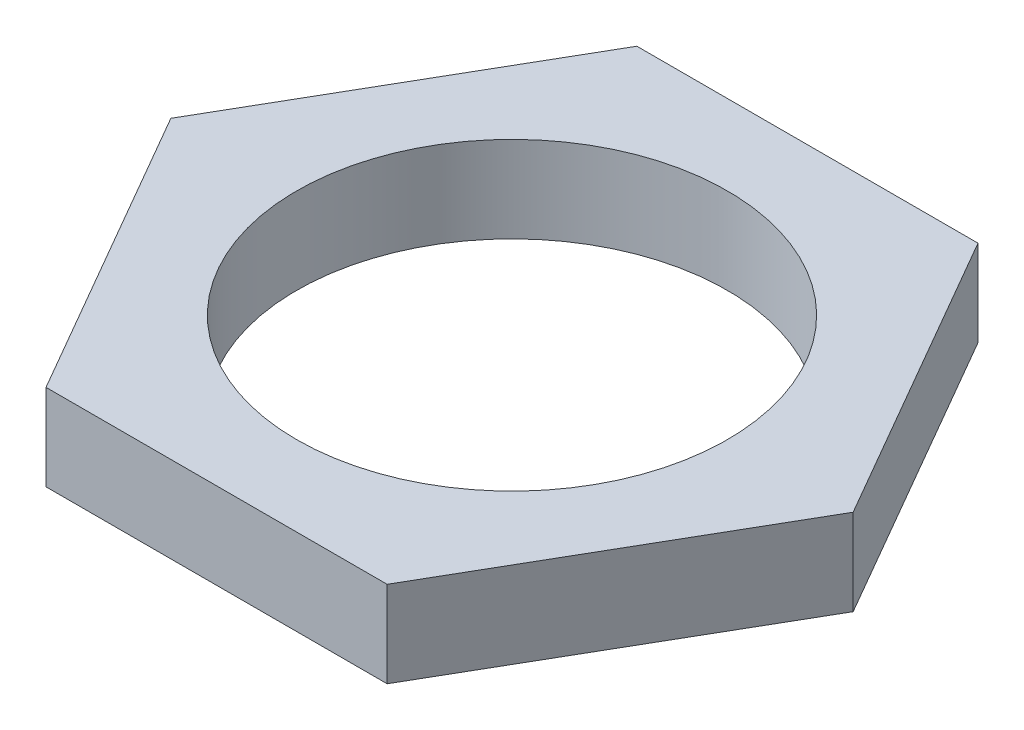
ISO-10303-21;
HEADER;
FILE_DESCRIPTION(('STEP AP214'),'2;1');
FILE_NAME('part.step','',(''),(''),'','','');
FILE_SCHEMA(('AUTOMOTIVE_DESIGN { 1 0 10303 214 1 1 1 1 }'));
ENDSEC;
DATA;
#1=APPLICATION_CONTEXT('core data for automotive mechanical design processes');
#2=APPLICATION_PROTOCOL_DEFINITION('international standard','automotive_design',2000,#1);
#3=PRODUCT_CONTEXT('',#1,'mechanical');
#4=PRODUCT('Part','Part','',(#3));
#5=PRODUCT_RELATED_PRODUCT_CATEGORY('part','',(#4));
#6=PRODUCT_DEFINITION_FORMATION('','',#4);
#7=PRODUCT_DEFINITION_CONTEXT('part definition',#1,'design');
#8=PRODUCT_DEFINITION('design','',#6,#7);
#9=PRODUCT_DEFINITION_SHAPE('','',#8);
#10=(LENGTH_UNIT() NAMED_UNIT(*) SI_UNIT(.MILLI.,.METRE.));
#11=(NAMED_UNIT(*) PLANE_ANGLE_UNIT() SI_UNIT($,.RADIAN.));
#12=(NAMED_UNIT(*) SI_UNIT($,.STERADIAN.) SOLID_ANGLE_UNIT());
#13=UNCERTAINTY_MEASURE_WITH_UNIT(LENGTH_MEASURE(1.E-05),#10,'distance_accuracy_value','');
#14=(GEOMETRIC_REPRESENTATION_CONTEXT(3) GLOBAL_UNCERTAINTY_ASSIGNED_CONTEXT((#13)) GLOBAL_UNIT_ASSIGNED_CONTEXT((#10,
#11,#12)) REPRESENTATION_CONTEXT('',''));
#15=CARTESIAN_POINT('',(0.,0.,0.));
#16=DIRECTION('',(0.,0.,1.));
#17=DIRECTION('',(1.,0.,0.));
#18=AXIS2_PLACEMENT_3D('',#15,#16,#17);
#19=CARTESIAN_POINT('',(0.,3.5,0.));
#20=DIRECTION('',(0.,1.,0.));
#21=DIRECTION('',(0.,0.,1.));
#22=AXIS2_PLACEMENT_3D('',#19,#20,#21);
#23=PLANE('',#22);
#24=DIRECTION('',(0.5,0.,0.866025403784438));
#25=VECTOR('',#24,1.);
#26=CARTESIAN_POINT('',(-13.856406460551,3.5,0.));
#27=LINE('',#26,#25);
#28=CARTESIAN_POINT('',(-13.856406460551,3.5,0.));
#29=VERTEX_POINT('',#28);
#30=CARTESIAN_POINT('',(-6.92820323027551,3.5,12.));
#31=VERTEX_POINT('',#30);
#32=EDGE_CURVE('E138',#29,#31,#27,.T.);
#33=ORIENTED_EDGE('',*,*,#32,.T.);
#34=DIRECTION('',(1.,0.,0.));
#35=VECTOR('',#34,1.);
#36=CARTESIAN_POINT('',(-6.92820323027551,3.5,12.));
#37=LINE('',#36,#35);
#38=CARTESIAN_POINT('',(6.92820323027551,3.5,12.));
#39=VERTEX_POINT('',#38);
#40=EDGE_CURVE('E96',#31,#39,#37,.T.);
#41=ORIENTED_EDGE('',*,*,#40,.T.);
#42=DIRECTION('',(0.5,0.,-0.866025403784439));
#43=VECTOR('',#42,1.);
#44=CARTESIAN_POINT('',(6.92820323027551,3.5,12.));
#45=LINE('',#44,#43);
#46=CARTESIAN_POINT('',(13.856406460551,3.5,0.));
#47=VERTEX_POINT('',#46);
#48=EDGE_CURVE('E109',#39,#47,#45,.T.);
#49=ORIENTED_EDGE('',*,*,#48,.T.);
#50=DIRECTION('',(-0.5,0.,-0.866025403784439));
#51=VECTOR('',#50,1.);
#52=CARTESIAN_POINT('',(13.856406460551,3.5,0.));
#53=LINE('',#52,#51);
#54=CARTESIAN_POINT('',(6.92820323027551,3.5,-12.));
#55=VERTEX_POINT('',#54);
#56=EDGE_CURVE('E103',#47,#55,#53,.T.);
#57=ORIENTED_EDGE('',*,*,#56,.T.);
#58=DIRECTION('',(-1.,0.,0.));
#59=VECTOR('',#58,1.);
#60=CARTESIAN_POINT('',(6.92820323027551,3.5,-12.));
#61=LINE('',#60,#59);
#62=CARTESIAN_POINT('',(-6.92820323027551,3.5,-12.));
#63=VERTEX_POINT('',#62);
#64=EDGE_CURVE('E107',#55,#63,#61,.T.);
#65=ORIENTED_EDGE('',*,*,#64,.T.);
#66=DIRECTION('',(-0.5,0.,0.866025403784439));
#67=VECTOR('',#66,1.);
#68=CARTESIAN_POINT('',(-6.92820323027551,3.5,-12.));
#69=LINE('',#68,#67);
#70=EDGE_CURVE('E59',#63,#29,#69,.T.);
#71=ORIENTED_EDGE('',*,*,#70,.T.);
#72=EDGE_LOOP('',(#33,#41,#49,#57,#65,#71));
#73=FACE_BOUND('',#72,.T.);
#74=CARTESIAN_POINT('',(0.,3.5,0.));
#75=DIRECTION('',(0.,1.,0.));
#76=DIRECTION('',(0.,0.,1.));
#77=AXIS2_PLACEMENT_3D('',#74,#75,#76);
#78=CIRCLE('',#77,8.75);
#79=CARTESIAN_POINT('',(0.,3.5,8.75));
#80=VERTEX_POINT('',#79);
#81=EDGE_CURVE('E131',#80,#80,#78,.T.);
#82=ORIENTED_EDGE('',*,*,#81,.F.);
#83=EDGE_LOOP('',(#82));
#84=FACE_BOUND('',#83,.T.);
#85=ADVANCED_FACE('F42',(#73,#84),#23,.T.);
#86=CARTESIAN_POINT('',(0.,0.,0.));
#87=DIRECTION('',(0.,1.,0.));
#88=DIRECTION('',(0.,0.,1.));
#89=AXIS2_PLACEMENT_3D('',#86,#87,#88);
#90=PLANE('',#89);
#91=DIRECTION('',(0.5,0.,0.866025403784438));
#92=VECTOR('',#91,1.);
#93=CARTESIAN_POINT('',(-13.856406460551,0.,0.));
#94=LINE('',#93,#92);
#95=CARTESIAN_POINT('',(-13.856406460551,0.,0.));
#96=VERTEX_POINT('',#95);
#97=CARTESIAN_POINT('',(-6.92820323027551,0.,12.));
#98=VERTEX_POINT('',#97);
#99=EDGE_CURVE('E127',#96,#98,#94,.T.);
#100=ORIENTED_EDGE('',*,*,#99,.F.);
#101=DIRECTION('',(-0.5,0.,0.866025403784439));
#102=VECTOR('',#101,1.);
#103=CARTESIAN_POINT('',(-6.92820323027551,0.,-12.));
#104=LINE('',#103,#102);
#105=CARTESIAN_POINT('',(-6.92820323027551,0.,-12.));
#106=VERTEX_POINT('',#105);
#107=EDGE_CURVE('E88',#106,#96,#104,.T.);
#108=ORIENTED_EDGE('',*,*,#107,.F.);
#109=DIRECTION('',(-1.,0.,0.));
#110=VECTOR('',#109,1.);
#111=CARTESIAN_POINT('',(6.92820323027551,0.,-12.));
#112=LINE('',#111,#110);
#113=CARTESIAN_POINT('',(6.92820323027551,0.,-12.));
#114=VERTEX_POINT('',#113);
#115=EDGE_CURVE('E82',#114,#106,#112,.T.);
#116=ORIENTED_EDGE('',*,*,#115,.F.);
#117=DIRECTION('',(-0.5,0.,-0.866025403784439));
#118=VECTOR('',#117,1.);
#119=CARTESIAN_POINT('',(13.856406460551,0.,0.));
#120=LINE('',#119,#118);
#121=CARTESIAN_POINT('',(13.856406460551,0.,0.));
#122=VERTEX_POINT('',#121);
#123=EDGE_CURVE('E117',#122,#114,#120,.T.);
#124=ORIENTED_EDGE('',*,*,#123,.F.);
#125=DIRECTION('',(0.5,0.,-0.866025403784439));
#126=VECTOR('',#125,1.);
#127=CARTESIAN_POINT('',(6.92820323027551,0.,12.));
#128=LINE('',#127,#126);
#129=CARTESIAN_POINT('',(6.92820323027551,0.,12.));
#130=VERTEX_POINT('',#129);
#131=EDGE_CURVE('E133',#130,#122,#128,.T.);
#132=ORIENTED_EDGE('',*,*,#131,.F.);
#133=DIRECTION('',(1.,0.,0.));
#134=VECTOR('',#133,1.);
#135=CARTESIAN_POINT('',(-6.92820323027551,0.,12.));
#136=LINE('',#135,#134);
#137=EDGE_CURVE('E130',#98,#130,#136,.T.);
#138=ORIENTED_EDGE('',*,*,#137,.F.);
#139=EDGE_LOOP('',(#100,#108,#116,#124,#132,#138));
#140=FACE_BOUND('',#139,.T.);
#141=CARTESIAN_POINT('',(0.,0.,0.));
#142=DIRECTION('',(0.,1.,0.));
#143=DIRECTION('',(0.,0.,1.));
#144=AXIS2_PLACEMENT_3D('',#141,#142,#143);
#145=CIRCLE('',#144,8.75);
#146=CARTESIAN_POINT('',(0.,0.,8.75));
#147=VERTEX_POINT('',#146);
#148=EDGE_CURVE('E231',#147,#147,#145,.T.);
#149=ORIENTED_EDGE('',*,*,#148,.T.);
#150=EDGE_LOOP('',(#149));
#151=FACE_BOUND('',#150,.T.);
#152=ADVANCED_FACE('F147',(#140,#151),#90,.F.);
#153=CARTESIAN_POINT('',(-13.856406460551,3.5,0.));
#154=DIRECTION('',(0.866025403784438,0.,-0.5));
#155=DIRECTION('',(-0.5,0.,-0.866025403784439));
#156=AXIS2_PLACEMENT_3D('',#153,#154,#155);
#157=PLANE('',#156);
#158=ORIENTED_EDGE('',*,*,#99,.T.);
#159=DIRECTION('',(0.,-1.,0.));
#160=VECTOR('',#159,1.);
#161=CARTESIAN_POINT('',(-6.92820323027551,3.5,12.));
#162=LINE('',#161,#160);
#163=EDGE_CURVE('E13',#31,#98,#162,.T.);
#164=ORIENTED_EDGE('',*,*,#163,.F.);
#165=ORIENTED_EDGE('',*,*,#32,.F.);
#166=DIRECTION('',(0.,-1.,0.));
#167=VECTOR('',#166,1.);
#168=CARTESIAN_POINT('',(-13.856406460551,3.5,0.));
#169=LINE('',#168,#167);
#170=EDGE_CURVE('E123',#29,#96,#169,.T.);
#171=ORIENTED_EDGE('',*,*,#170,.T.);
#172=EDGE_LOOP('',(#158,#164,#165,#171));
#173=FACE_BOUND('',#172,.T.);
#174=ADVANCED_FACE('F44',(#173),#157,.F.);
#175=CARTESIAN_POINT('',(-6.92820323027551,3.5,12.));
#176=DIRECTION('',(0.,0.,-1.));
#177=DIRECTION('',(-1.,0.,0.));
#178=AXIS2_PLACEMENT_3D('',#175,#176,#177);
#179=PLANE('',#178);
#180=ORIENTED_EDGE('',*,*,#137,.T.);
#181=DIRECTION('',(0.,-1.,0.));
#182=VECTOR('',#181,1.);
#183=CARTESIAN_POINT('',(6.92820323027551,3.5,12.));
#184=LINE('',#183,#182);
#185=EDGE_CURVE('E51',#39,#130,#184,.T.);
#186=ORIENTED_EDGE('',*,*,#185,.F.);
#187=ORIENTED_EDGE('',*,*,#40,.F.);
#188=ORIENTED_EDGE('',*,*,#163,.T.);
#189=EDGE_LOOP('',(#180,#186,#187,#188));
#190=FACE_BOUND('',#189,.T.);
#191=ADVANCED_FACE('F172',(#190),#179,.F.);
#192=CARTESIAN_POINT('',(6.92820323027551,3.5,12.));
#193=DIRECTION('',(-0.866025403784439,0.,-0.5));
#194=DIRECTION('',(-0.5,0.,0.866025403784439));
#195=AXIS2_PLACEMENT_3D('',#192,#193,#194);
#196=PLANE('',#195);
#197=ORIENTED_EDGE('',*,*,#131,.T.);
#198=DIRECTION('',(0.,-1.,0.));
#199=VECTOR('',#198,1.);
#200=CARTESIAN_POINT('',(13.856406460551,3.5,0.));
#201=LINE('',#200,#199);
#202=EDGE_CURVE('E118',#47,#122,#201,.T.);
#203=ORIENTED_EDGE('',*,*,#202,.F.);
#204=ORIENTED_EDGE('',*,*,#48,.F.);
#205=ORIENTED_EDGE('',*,*,#185,.T.);
#206=EDGE_LOOP('',(#197,#203,#204,#205));
#207=FACE_BOUND('',#206,.T.);
#208=ADVANCED_FACE('F144',(#207),#196,.F.);
#209=CARTESIAN_POINT('',(13.856406460551,3.5,0.));
#210=DIRECTION('',(-0.866025403784439,0.,0.5));
#211=DIRECTION('',(0.5,0.,0.866025403784439));
#212=AXIS2_PLACEMENT_3D('',#209,#210,#211);
#213=PLANE('',#212);
#214=ORIENTED_EDGE('',*,*,#123,.T.);
#215=DIRECTION('',(0.,-1.,0.));
#216=VECTOR('',#215,1.);
#217=CARTESIAN_POINT('',(6.92820323027551,3.5,-12.));
#218=LINE('',#217,#216);
#219=EDGE_CURVE('E114',#55,#114,#218,.T.);
#220=ORIENTED_EDGE('',*,*,#219,.F.);
#221=ORIENTED_EDGE('',*,*,#56,.F.);
#222=ORIENTED_EDGE('',*,*,#202,.T.);
#223=EDGE_LOOP('',(#214,#220,#221,#222));
#224=FACE_BOUND('',#223,.T.);
#225=ADVANCED_FACE('F115',(#224),#213,.F.);
#226=CARTESIAN_POINT('',(6.92820323027551,3.5,-12.));
#227=DIRECTION('',(0.,0.,1.));
#228=DIRECTION('',(1.,0.,0.));
#229=AXIS2_PLACEMENT_3D('',#226,#227,#228);
#230=PLANE('',#229);
#231=ORIENTED_EDGE('',*,*,#115,.T.);
#232=DIRECTION('',(0.,-1.,0.));
#233=VECTOR('',#232,1.);
#234=CARTESIAN_POINT('',(-6.92820323027551,3.5,-12.));
#235=LINE('',#234,#233);
#236=EDGE_CURVE('E119',#63,#106,#235,.T.);
#237=ORIENTED_EDGE('',*,*,#236,.F.);
#238=ORIENTED_EDGE('',*,*,#64,.F.);
#239=ORIENTED_EDGE('',*,*,#219,.T.);
#240=EDGE_LOOP('',(#231,#237,#238,#239));
#241=FACE_BOUND('',#240,.T.);
#242=ADVANCED_FACE('F121',(#241),#230,.F.);
#243=CARTESIAN_POINT('',(-6.92820323027551,3.5,-12.));
#244=DIRECTION('',(0.866025403784439,0.,0.5));
#245=DIRECTION('',(0.5,0.,-0.866025403784439));
#246=AXIS2_PLACEMENT_3D('',#243,#244,#245);
#247=PLANE('',#246);
#248=ORIENTED_EDGE('',*,*,#107,.T.);
#249=ORIENTED_EDGE('',*,*,#170,.F.);
#250=ORIENTED_EDGE('',*,*,#70,.F.);
#251=ORIENTED_EDGE('',*,*,#236,.T.);
#252=EDGE_LOOP('',(#248,#249,#250,#251));
#253=FACE_BOUND('',#252,.T.);
#254=ADVANCED_FACE('F152',(#253),#247,.F.);
#255=CARTESIAN_POINT('',(0.,3.5,0.));
#256=DIRECTION('',(0.,-1.,0.));
#257=DIRECTION('',(0.,0.,-1.));
#258=AXIS2_PLACEMENT_3D('',#255,#256,#257);
#259=CYLINDRICAL_SURFACE('',#258,8.75);
#260=ORIENTED_EDGE('',*,*,#81,.T.);
#261=EDGE_LOOP('',(#260));
#262=FACE_BOUND('',#261,.T.);
#263=ORIENTED_EDGE('',*,*,#148,.F.);
#264=EDGE_LOOP('',(#263));
#265=FACE_BOUND('',#264,.T.);
#266=ADVANCED_FACE('F154',(#262,#265),#259,.F.);
#267=CLOSED_SHELL('',(#85,#152,#174,#191,#208,#225,#242,#254,#266));
#268=MANIFOLD_SOLID_BREP('B2',#267);
#269=ADVANCED_BREP_SHAPE_REPRESENTATION('',(#18,#268),#14);
#270=SHAPE_DEFINITION_REPRESENTATION(#9,#269);
ENDSEC;
END-ISO-10303-21;
